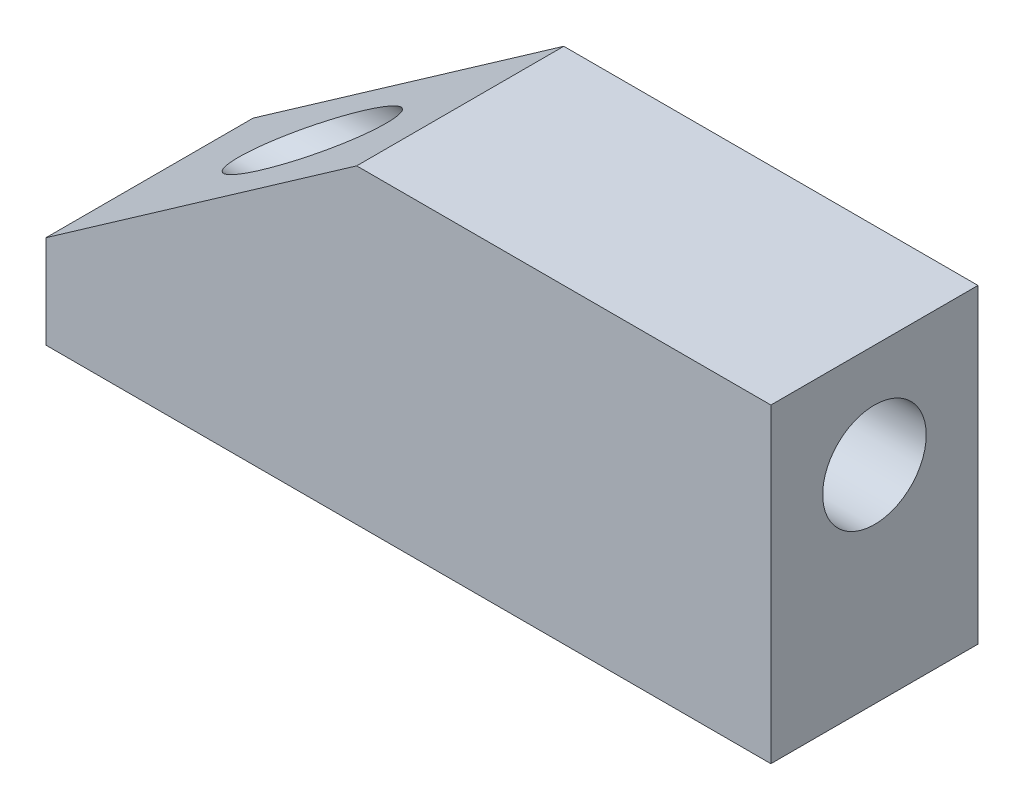
ISO-10303-21;
HEADER;
FILE_DESCRIPTION(('STEP AP214'),'2;1');
FILE_NAME('part.step','',(''),(''),'','','');
FILE_SCHEMA(('AUTOMOTIVE_DESIGN { 1 0 10303 214 1 1 1 1 }'));
ENDSEC;
DATA;
#1=APPLICATION_CONTEXT('core data for automotive mechanical design processes');
#2=APPLICATION_PROTOCOL_DEFINITION('international standard','automotive_design',2000,#1);
#3=PRODUCT_CONTEXT('',#1,'mechanical');
#4=PRODUCT('Part','Part','',(#3));
#5=PRODUCT_RELATED_PRODUCT_CATEGORY('part','',(#4));
#6=PRODUCT_DEFINITION_FORMATION('','',#4);
#7=PRODUCT_DEFINITION_CONTEXT('part definition',#1,'design');
#8=PRODUCT_DEFINITION('design','',#6,#7);
#9=PRODUCT_DEFINITION_SHAPE('','',#8);
#10=(LENGTH_UNIT() NAMED_UNIT(*) SI_UNIT(.MILLI.,.METRE.));
#11=(NAMED_UNIT(*) PLANE_ANGLE_UNIT() SI_UNIT($,.RADIAN.));
#12=(NAMED_UNIT(*) SI_UNIT($,.STERADIAN.) SOLID_ANGLE_UNIT());
#13=UNCERTAINTY_MEASURE_WITH_UNIT(LENGTH_MEASURE(1.E-05),#10,'distance_accuracy_value','');
#14=(GEOMETRIC_REPRESENTATION_CONTEXT(3) GLOBAL_UNCERTAINTY_ASSIGNED_CONTEXT((#13)) GLOBAL_UNIT_ASSIGNED_CONTEXT((#10,
#11,#12)) REPRESENTATION_CONTEXT('',''));
#15=CARTESIAN_POINT('',(0.,0.,0.));
#16=DIRECTION('',(0.,0.,1.));
#17=DIRECTION('',(1.,0.,0.));
#18=AXIS2_PLACEMENT_3D('',#15,#16,#17);
#19=CARTESIAN_POINT('',(83.4874047464772,20.4279004086905,10.));
#20=DIRECTION('',(0.,1.,0.));
#21=DIRECTION('',(-1.,0.,0.));
#22=AXIS2_PLACEMENT_3D('',#19,#20,#21);
#23=PLANE('',#22);
#24=DIRECTION('',(1.,0.,0.));
#25=VECTOR('',#24,1.);
#26=CARTESIAN_POINT('',(83.4874047464772,20.4279004086905,0.));
#27=LINE('',#26,#25);
#28=CARTESIAN_POINT('',(48.4874047464772,20.4279004086904,0.));
#29=VERTEX_POINT('',#28);
#30=CARTESIAN_POINT('',(83.4874047464772,20.4279004086905,0.));
#31=VERTEX_POINT('',#30);
#32=EDGE_CURVE('E113',#29,#31,#27,.T.);
#33=ORIENTED_EDGE('',*,*,#32,.T.);
#34=DIRECTION('',(0.,0.,-1.));
#35=VECTOR('',#34,1.);
#36=CARTESIAN_POINT('',(83.4874047464772,20.4279004086905,10.));
#37=LINE('',#36,#35);
#38=CARTESIAN_POINT('',(83.4874047464772,20.4279004086905,10.));
#39=VERTEX_POINT('',#38);
#40=EDGE_CURVE('E11',#39,#31,#37,.T.);
#41=ORIENTED_EDGE('',*,*,#40,.F.);
#42=DIRECTION('',(1.,0.,0.));
#43=VECTOR('',#42,1.);
#44=CARTESIAN_POINT('',(83.4874047464772,20.4279004086905,10.));
#45=LINE('',#44,#43);
#46=CARTESIAN_POINT('',(48.4874047464772,20.4279004086904,10.));
#47=VERTEX_POINT('',#46);
#48=EDGE_CURVE('E121',#47,#39,#45,.T.);
#49=ORIENTED_EDGE('',*,*,#48,.F.);
#50=DIRECTION('',(0.,0.,-1.));
#51=VECTOR('',#50,1.);
#52=CARTESIAN_POINT('',(48.4874047464772,20.4279004086904,10.));
#53=LINE('',#52,#51);
#54=EDGE_CURVE('E109',#47,#29,#53,.T.);
#55=ORIENTED_EDGE('',*,*,#54,.T.);
#56=EDGE_LOOP('',(#33,#41,#49,#55));
#57=FACE_BOUND('',#56,.T.);
#58=ADVANCED_FACE('F38',(#57),#23,.F.);
#59=CARTESIAN_POINT('',(83.4874047464772,35.4279004086905,10.));
#60=DIRECTION('',(-1.,0.,0.));
#61=DIRECTION('',(0.,0.,1.));
#62=AXIS2_PLACEMENT_3D('',#59,#60,#61);
#63=PLANE('',#62);
#64=CARTESIAN_POINT('',(83.4874047464772,30.4279004086905,5.));
#65=DIRECTION('',(1.,0.,0.));
#66=DIRECTION('',(0.,0.,-1.));
#67=AXIS2_PLACEMENT_3D('',#64,#65,#66);
#68=CIRCLE('',#67,2.5);
#69=CARTESIAN_POINT('',(83.4874047464772,30.4279004086905,2.5));
#70=VERTEX_POINT('',#69);
#71=EDGE_CURVE('E153',#70,#70,#68,.T.);
#72=ORIENTED_EDGE('',*,*,#71,.F.);
#73=EDGE_LOOP('',(#72));
#74=FACE_BOUND('',#73,.T.);
#75=DIRECTION('',(0.,1.,0.));
#76=VECTOR('',#75,1.);
#77=CARTESIAN_POINT('',(83.4874047464772,35.4279004086905,0.));
#78=LINE('',#77,#76);
#79=CARTESIAN_POINT('',(83.4874047464772,35.4279004086905,0.));
#80=VERTEX_POINT('',#79);
#81=EDGE_CURVE('E116',#31,#80,#78,.T.);
#82=ORIENTED_EDGE('',*,*,#81,.T.);
#83=DIRECTION('',(0.,0.,-1.));
#84=VECTOR('',#83,1.);
#85=CARTESIAN_POINT('',(83.4874047464772,35.4279004086905,10.));
#86=LINE('',#85,#84);
#87=CARTESIAN_POINT('',(83.4874047464772,35.4279004086905,10.));
#88=VERTEX_POINT('',#87);
#89=EDGE_CURVE('E47',#88,#80,#86,.T.);
#90=ORIENTED_EDGE('',*,*,#89,.F.);
#91=DIRECTION('',(0.,1.,0.));
#92=VECTOR('',#91,1.);
#93=CARTESIAN_POINT('',(83.4874047464772,35.4279004086905,10.));
#94=LINE('',#93,#92);
#95=EDGE_CURVE('E89',#39,#88,#94,.T.);
#96=ORIENTED_EDGE('',*,*,#95,.F.);
#97=ORIENTED_EDGE('',*,*,#40,.T.);
#98=EDGE_LOOP('',(#82,#90,#96,#97));
#99=FACE_BOUND('',#98,.T.);
#100=ADVANCED_FACE('F142',(#74,#99),#63,.F.);
#101=CARTESIAN_POINT('',(63.4874047464772,35.4279004086905,10.));
#102=DIRECTION('',(0.,-1.,0.));
#103=DIRECTION('',(0.,0.,-1.));
#104=AXIS2_PLACEMENT_3D('',#101,#102,#103);
#105=PLANE('',#104);
#106=DIRECTION('',(-1.,0.,0.));
#107=VECTOR('',#106,1.);
#108=CARTESIAN_POINT('',(63.4874047464772,35.4279004086905,0.));
#109=LINE('',#108,#107);
#110=CARTESIAN_POINT('',(63.4874047464772,35.4279004086905,0.));
#111=VERTEX_POINT('',#110);
#112=EDGE_CURVE('E104',#80,#111,#109,.T.);
#113=ORIENTED_EDGE('',*,*,#112,.T.);
#114=DIRECTION('',(0.,0.,-1.));
#115=VECTOR('',#114,1.);
#116=CARTESIAN_POINT('',(63.4874047464772,35.4279004086905,10.));
#117=LINE('',#116,#115);
#118=CARTESIAN_POINT('',(63.4874047464772,35.4279004086905,10.));
#119=VERTEX_POINT('',#118);
#120=EDGE_CURVE('E101',#119,#111,#117,.T.);
#121=ORIENTED_EDGE('',*,*,#120,.F.);
#122=DIRECTION('',(-1.,0.,0.));
#123=VECTOR('',#122,1.);
#124=CARTESIAN_POINT('',(63.4874047464772,35.4279004086905,10.));
#125=LINE('',#124,#123);
#126=EDGE_CURVE('E93',#88,#119,#125,.T.);
#127=ORIENTED_EDGE('',*,*,#126,.F.);
#128=ORIENTED_EDGE('',*,*,#89,.T.);
#129=EDGE_LOOP('',(#113,#121,#127,#128));
#130=FACE_BOUND('',#129,.T.);
#131=ADVANCED_FACE('F102',(#130),#105,.F.);
#132=CARTESIAN_POINT('',(48.4874047464772,24.9247873355447,10.));
#133=DIRECTION('',(0.57357643635105,-0.819152044288989,0.));
#134=DIRECTION('',(0.819152044288989,0.57357643635105,0.));
#135=AXIS2_PLACEMENT_3D('',#132,#133,#134);
#136=PLANE('',#135);
#137=CARTESIAN_POINT('',(56.3466647127667,30.4279004086905,5.));
#138=DIRECTION('',(0.57357643635105,-0.819152044288989,0.));
#139=DIRECTION('',(0.819152044288989,0.57357643635105,0.));
#140=AXIS2_PLACEMENT_3D('',#137,#138,#139);
#141=ELLIPSE('',#140,4.35861698905271,2.5);
#142=CARTESIAN_POINT('',(59.917034729622,32.9279004086905,5.));
#143=VERTEX_POINT('',#142);
#144=EDGE_CURVE('E41',#143,#143,#141,.T.);
#145=ORIENTED_EDGE('',*,*,#144,.T.);
#146=EDGE_LOOP('',(#145));
#147=FACE_BOUND('',#146,.T.);
#148=DIRECTION('',(-0.819152044288989,-0.57357643635105,0.));
#149=VECTOR('',#148,1.);
#150=CARTESIAN_POINT('',(48.4874047464772,24.9247873355447,0.));
#151=LINE('',#150,#149);
#152=CARTESIAN_POINT('',(48.4874047464772,24.9247873355447,0.));
#153=VERTEX_POINT('',#152);
#154=EDGE_CURVE('E75',#111,#153,#151,.T.);
#155=ORIENTED_EDGE('',*,*,#154,.T.);
#156=DIRECTION('',(0.,0.,-1.));
#157=VECTOR('',#156,1.);
#158=CARTESIAN_POINT('',(48.4874047464772,24.9247873355447,10.));
#159=LINE('',#158,#157);
#160=CARTESIAN_POINT('',(48.4874047464772,24.9247873355447,10.));
#161=VERTEX_POINT('',#160);
#162=EDGE_CURVE('E105',#161,#153,#159,.T.);
#163=ORIENTED_EDGE('',*,*,#162,.F.);
#164=DIRECTION('',(-0.819152044288989,-0.57357643635105,0.));
#165=VECTOR('',#164,1.);
#166=CARTESIAN_POINT('',(48.4874047464772,24.9247873355447,10.));
#167=LINE('',#166,#165);
#168=EDGE_CURVE('E97',#119,#161,#167,.T.);
#169=ORIENTED_EDGE('',*,*,#168,.F.);
#170=ORIENTED_EDGE('',*,*,#120,.T.);
#171=EDGE_LOOP('',(#155,#163,#169,#170));
#172=FACE_BOUND('',#171,.T.);
#173=ADVANCED_FACE('F107',(#147,#172),#136,.F.);
#174=CARTESIAN_POINT('',(48.4874047464772,20.4279004086904,10.));
#175=DIRECTION('',(1.,0.,0.));
#176=DIRECTION('',(0.,0.,-1.));
#177=AXIS2_PLACEMENT_3D('',#174,#175,#176);
#178=PLANE('',#177);
#179=DIRECTION('',(0.,-1.,0.));
#180=VECTOR('',#179,1.);
#181=CARTESIAN_POINT('',(48.4874047464772,20.4279004086904,0.));
#182=LINE('',#181,#180);
#183=EDGE_CURVE('E81',#153,#29,#182,.T.);
#184=ORIENTED_EDGE('',*,*,#183,.T.);
#185=ORIENTED_EDGE('',*,*,#54,.F.);
#186=DIRECTION('',(0.,-1.,0.));
#187=VECTOR('',#186,1.);
#188=CARTESIAN_POINT('',(48.4874047464772,20.4279004086904,10.));
#189=LINE('',#188,#187);
#190=EDGE_CURVE('E55',#161,#47,#189,.T.);
#191=ORIENTED_EDGE('',*,*,#190,.F.);
#192=ORIENTED_EDGE('',*,*,#162,.T.);
#193=EDGE_LOOP('',(#184,#185,#191,#192));
#194=FACE_BOUND('',#193,.T.);
#195=ADVANCED_FACE('F130',(#194),#178,.F.);
#196=CARTESIAN_POINT('',(0.,0.,10.));
#197=DIRECTION('',(0.,0.,-1.));
#198=DIRECTION('',(-1.,0.,0.));
#199=AXIS2_PLACEMENT_3D('',#196,#197,#198);
#200=PLANE('',#199);
#201=ORIENTED_EDGE('',*,*,#48,.T.);
#202=ORIENTED_EDGE('',*,*,#95,.T.);
#203=ORIENTED_EDGE('',*,*,#126,.T.);
#204=ORIENTED_EDGE('',*,*,#168,.T.);
#205=ORIENTED_EDGE('',*,*,#190,.T.);
#206=EDGE_LOOP('',(#201,#202,#203,#204,#205));
#207=FACE_BOUND('',#206,.T.);
#208=ADVANCED_FACE('F95',(#207),#200,.F.);
#209=CARTESIAN_POINT('',(0.,0.,0.));
#210=DIRECTION('',(0.,0.,-1.));
#211=DIRECTION('',(-1.,0.,0.));
#212=AXIS2_PLACEMENT_3D('',#209,#210,#211);
#213=PLANE('',#212);
#214=ORIENTED_EDGE('',*,*,#32,.F.);
#215=ORIENTED_EDGE('',*,*,#183,.F.);
#216=ORIENTED_EDGE('',*,*,#154,.F.);
#217=ORIENTED_EDGE('',*,*,#112,.F.);
#218=ORIENTED_EDGE('',*,*,#81,.F.);
#219=EDGE_LOOP('',(#214,#215,#216,#217,#218));
#220=FACE_BOUND('',#219,.T.);
#221=ADVANCED_FACE('F126',(#220),#213,.T.);
#222=CARTESIAN_POINT('',(48.4874047464772,30.4279004086905,5.));
#223=DIRECTION('',(1.,0.,0.));
#224=DIRECTION('',(0.,0.,-1.));
#225=AXIS2_PLACEMENT_3D('',#222,#223,#224);
#226=CYLINDRICAL_SURFACE('',#225,2.5);
#227=ORIENTED_EDGE('',*,*,#71,.T.);
#228=EDGE_LOOP('',(#227));
#229=FACE_BOUND('',#228,.T.);
#230=ORIENTED_EDGE('',*,*,#144,.F.);
#231=EDGE_LOOP('',(#230));
#232=FACE_BOUND('',#231,.T.);
#233=ADVANCED_FACE('F160',(#229,#232),#226,.F.);
#234=CLOSED_SHELL('',(#58,#100,#131,#173,#195,#208,#221,#233));
#235=MANIFOLD_SOLID_BREP('B2',#234);
#236=ADVANCED_BREP_SHAPE_REPRESENTATION('',(#18,#235),#14);
#237=SHAPE_DEFINITION_REPRESENTATION(#9,#236);
ENDSEC;
END-ISO-10303-21;
